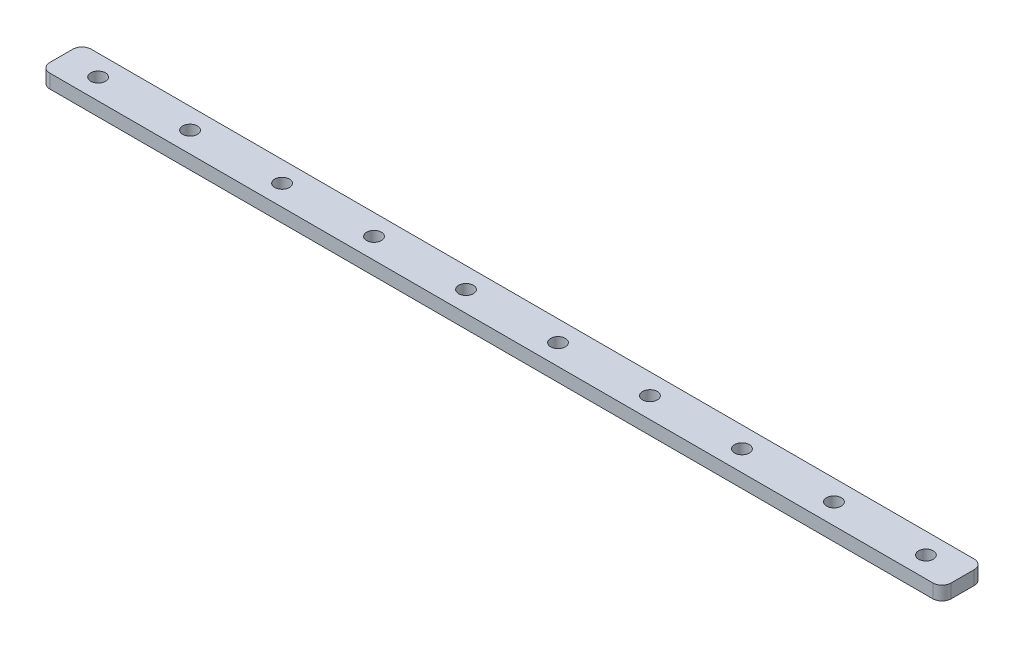
ISO-10303-21;
HEADER;
FILE_DESCRIPTION(('STEP AP214'),'2;1');
FILE_NAME('part.step','',(''),(''),'','','');
FILE_SCHEMA(('AUTOMOTIVE_DESIGN { 1 0 10303 214 1 1 1 1 }'));
ENDSEC;
DATA;
#1=APPLICATION_CONTEXT('core data for automotive mechanical design processes');
#2=APPLICATION_PROTOCOL_DEFINITION('international standard','automotive_design',2000,#1);
#3=PRODUCT_CONTEXT('',#1,'mechanical');
#4=PRODUCT('Part','Part','',(#3));
#5=PRODUCT_RELATED_PRODUCT_CATEGORY('part','',(#4));
#6=PRODUCT_DEFINITION_FORMATION('','',#4);
#7=PRODUCT_DEFINITION_CONTEXT('part definition',#1,'design');
#8=PRODUCT_DEFINITION('design','',#6,#7);
#9=PRODUCT_DEFINITION_SHAPE('','',#8);
#10=(LENGTH_UNIT() NAMED_UNIT(*) SI_UNIT(.MILLI.,.METRE.));
#11=(NAMED_UNIT(*) PLANE_ANGLE_UNIT() SI_UNIT($,.RADIAN.));
#12=(NAMED_UNIT(*) SI_UNIT($,.STERADIAN.) SOLID_ANGLE_UNIT());
#13=UNCERTAINTY_MEASURE_WITH_UNIT(LENGTH_MEASURE(1.E-05),#10,'distance_accuracy_value','');
#14=(GEOMETRIC_REPRESENTATION_CONTEXT(3) GLOBAL_UNCERTAINTY_ASSIGNED_CONTEXT((#13)) GLOBAL_UNIT_ASSIGNED_CONTEXT((#10,
#11,#12)) REPRESENTATION_CONTEXT('',''));
#15=CARTESIAN_POINT('',(0.,0.,0.));
#16=DIRECTION('',(0.,0.,1.));
#17=DIRECTION('',(1.,0.,0.));
#18=AXIS2_PLACEMENT_3D('',#15,#16,#17);
#19=CARTESIAN_POINT('',(0.,3.,0.));
#20=DIRECTION('',(0.,-1.,0.));
#21=DIRECTION('',(0.,0.,-1.));
#22=AXIS2_PLACEMENT_3D('',#19,#20,#21);
#23=PLANE('',#22);
#24=DIRECTION('',(-1.,0.,0.));
#25=VECTOR('',#24,1.);
#26=CARTESIAN_POINT('',(0.,3.,-9.));
#27=LINE('',#26,#25);
#28=CARTESIAN_POINT('',(194.,3.,-9.));
#29=VERTEX_POINT('',#28);
#30=CARTESIAN_POINT('',(2.,3.,-9.));
#31=VERTEX_POINT('',#30);
#32=EDGE_CURVE('E136',#29,#31,#27,.T.);
#33=ORIENTED_EDGE('',*,*,#32,.T.);
#34=CARTESIAN_POINT('',(2.,3.,-7.));
#35=DIRECTION('',(0.,-1.,0.));
#36=DIRECTION('',(0.,0.,-1.));
#37=AXIS2_PLACEMENT_3D('',#34,#35,#36);
#38=CIRCLE('',#37,2.);
#39=CARTESIAN_POINT('',(0.,3.,-7.));
#40=VERTEX_POINT('',#39);
#41=EDGE_CURVE('E155',#31,#40,#38,.F.);
#42=ORIENTED_EDGE('',*,*,#41,.T.);
#43=DIRECTION('',(0.,0.,1.));
#44=VECTOR('',#43,1.);
#45=CARTESIAN_POINT('',(0.,3.,0.));
#46=LINE('',#45,#44);
#47=CARTESIAN_POINT('',(0.,3.,-2.));
#48=VERTEX_POINT('',#47);
#49=EDGE_CURVE('E119',#40,#48,#46,.T.);
#50=ORIENTED_EDGE('',*,*,#49,.T.);
#51=CARTESIAN_POINT('',(2.,3.,-2.));
#52=DIRECTION('',(0.,-1.,0.));
#53=DIRECTION('',(0.,0.,-1.));
#54=AXIS2_PLACEMENT_3D('',#51,#52,#53);
#55=CIRCLE('',#54,2.);
#56=CARTESIAN_POINT('',(2.,3.,0.));
#57=VERTEX_POINT('',#56);
#58=EDGE_CURVE('E153',#48,#57,#55,.F.);
#59=ORIENTED_EDGE('',*,*,#58,.T.);
#60=DIRECTION('',(1.,0.,0.));
#61=VECTOR('',#60,1.);
#62=CARTESIAN_POINT('',(0.,3.,0.));
#63=LINE('',#62,#61);
#64=CARTESIAN_POINT('',(194.,3.,0.));
#65=VERTEX_POINT('',#64);
#66=EDGE_CURVE('E175',#57,#65,#63,.T.);
#67=ORIENTED_EDGE('',*,*,#66,.T.);
#68=CARTESIAN_POINT('',(194.,3.,-2.));
#69=DIRECTION('',(0.,-1.,0.));
#70=DIRECTION('',(0.,0.,-1.));
#71=AXIS2_PLACEMENT_3D('',#68,#69,#70);
#72=CIRCLE('',#71,2.);
#73=CARTESIAN_POINT('',(196.,3.,-1.99999999999999));
#74=VERTEX_POINT('',#73);
#75=EDGE_CURVE('E54',#65,#74,#72,.F.);
#76=ORIENTED_EDGE('',*,*,#75,.T.);
#77=DIRECTION('',(0.,0.,-1.));
#78=VECTOR('',#77,1.);
#79=CARTESIAN_POINT('',(196.,3.,0.));
#80=LINE('',#79,#78);
#81=CARTESIAN_POINT('',(196.,3.,-6.99999999999999));
#82=VERTEX_POINT('',#81);
#83=EDGE_CURVE('E165',#74,#82,#80,.T.);
#84=ORIENTED_EDGE('',*,*,#83,.T.);
#85=CARTESIAN_POINT('',(194.,3.,-7.));
#86=DIRECTION('',(0.,-1.,0.));
#87=DIRECTION('',(0.,0.,-1.));
#88=AXIS2_PLACEMENT_3D('',#85,#86,#87);
#89=CIRCLE('',#88,2.);
#90=EDGE_CURVE('E151',#82,#29,#89,.F.);
#91=ORIENTED_EDGE('',*,*,#90,.T.);
#92=EDGE_LOOP('',(#33,#42,#50,#59,#67,#76,#84,#91));
#93=FACE_BOUND('',#92,.T.);
#94=CARTESIAN_POINT('',(8.,3.,-4.5));
#95=DIRECTION('',(0.,1.,0.));
#96=DIRECTION('',(0.,0.,1.));
#97=AXIS2_PLACEMENT_3D('',#94,#95,#96);
#98=CIRCLE('',#97,1.6);
#99=CARTESIAN_POINT('',(8.,3.,-2.9));
#100=VERTEX_POINT('',#99);
#101=EDGE_CURVE('E127',#100,#100,#98,.T.);
#102=ORIENTED_EDGE('',*,*,#101,.F.);
#103=EDGE_LOOP('',(#102));
#104=FACE_BOUND('',#103,.T.);
#105=CARTESIAN_POINT('',(28.,3.,-4.5));
#106=DIRECTION('',(0.,1.,0.));
#107=DIRECTION('',(0.,0.,1.));
#108=AXIS2_PLACEMENT_3D('',#105,#106,#107);
#109=CIRCLE('',#108,1.60000000000001);
#110=CARTESIAN_POINT('',(28.,3.,-2.89999999999999));
#111=VERTEX_POINT('',#110);
#112=EDGE_CURVE('E180',#111,#111,#109,.T.);
#113=ORIENTED_EDGE('',*,*,#112,.F.);
#114=EDGE_LOOP('',(#113));
#115=FACE_BOUND('',#114,.T.);
#116=CARTESIAN_POINT('',(48.,3.,-4.5));
#117=DIRECTION('',(0.,1.,0.));
#118=DIRECTION('',(0.,0.,1.));
#119=AXIS2_PLACEMENT_3D('',#116,#117,#118);
#120=CIRCLE('',#119,1.6);
#121=CARTESIAN_POINT('',(48.,3.,-2.9));
#122=VERTEX_POINT('',#121);
#123=EDGE_CURVE('E185',#122,#122,#120,.T.);
#124=ORIENTED_EDGE('',*,*,#123,.F.);
#125=EDGE_LOOP('',(#124));
#126=FACE_BOUND('',#125,.T.);
#127=CARTESIAN_POINT('',(68.,3.,-4.5));
#128=DIRECTION('',(0.,1.,0.));
#129=DIRECTION('',(0.,0.,1.));
#130=AXIS2_PLACEMENT_3D('',#127,#128,#129);
#131=CIRCLE('',#130,1.60000000000001);
#132=CARTESIAN_POINT('',(68.,3.,-2.89999999999999));
#133=VERTEX_POINT('',#132);
#134=EDGE_CURVE('E191',#133,#133,#131,.T.);
#135=ORIENTED_EDGE('',*,*,#134,.F.);
#136=EDGE_LOOP('',(#135));
#137=FACE_BOUND('',#136,.T.);
#138=CARTESIAN_POINT('',(88.,3.,-4.5));
#139=DIRECTION('',(0.,1.,0.));
#140=DIRECTION('',(0.,0.,1.));
#141=AXIS2_PLACEMENT_3D('',#138,#139,#140);
#142=CIRCLE('',#141,1.60000000000001);
#143=CARTESIAN_POINT('',(88.,3.,-2.89999999999999));
#144=VERTEX_POINT('',#143);
#145=EDGE_CURVE('E197',#144,#144,#142,.T.);
#146=ORIENTED_EDGE('',*,*,#145,.F.);
#147=EDGE_LOOP('',(#146));
#148=FACE_BOUND('',#147,.T.);
#149=CARTESIAN_POINT('',(108.,3.,-4.5));
#150=DIRECTION('',(0.,1.,0.));
#151=DIRECTION('',(0.,0.,1.));
#152=AXIS2_PLACEMENT_3D('',#149,#150,#151);
#153=CIRCLE('',#152,1.60000000000001);
#154=CARTESIAN_POINT('',(108.,3.,-2.89999999999999));
#155=VERTEX_POINT('',#154);
#156=EDGE_CURVE('E203',#155,#155,#153,.T.);
#157=ORIENTED_EDGE('',*,*,#156,.F.);
#158=EDGE_LOOP('',(#157));
#159=FACE_BOUND('',#158,.T.);
#160=CARTESIAN_POINT('',(128.,3.,-4.5));
#161=DIRECTION('',(0.,1.,0.));
#162=DIRECTION('',(0.,0.,1.));
#163=AXIS2_PLACEMENT_3D('',#160,#161,#162);
#164=CIRCLE('',#163,1.59999999999999);
#165=CARTESIAN_POINT('',(128.,3.,-2.90000000000001));
#166=VERTEX_POINT('',#165);
#167=EDGE_CURVE('E209',#166,#166,#164,.T.);
#168=ORIENTED_EDGE('',*,*,#167,.F.);
#169=EDGE_LOOP('',(#168));
#170=FACE_BOUND('',#169,.T.);
#171=CARTESIAN_POINT('',(148.,3.,-4.5));
#172=DIRECTION('',(0.,1.,0.));
#173=DIRECTION('',(0.,0.,1.));
#174=AXIS2_PLACEMENT_3D('',#171,#172,#173);
#175=CIRCLE('',#174,1.59999999999999);
#176=CARTESIAN_POINT('',(148.,3.,-2.90000000000001));
#177=VERTEX_POINT('',#176);
#178=EDGE_CURVE('E215',#177,#177,#175,.T.);
#179=ORIENTED_EDGE('',*,*,#178,.F.);
#180=EDGE_LOOP('',(#179));
#181=FACE_BOUND('',#180,.T.);
#182=CARTESIAN_POINT('',(168.,3.,-4.5));
#183=DIRECTION('',(0.,1.,0.));
#184=DIRECTION('',(0.,0.,1.));
#185=AXIS2_PLACEMENT_3D('',#182,#183,#184);
#186=CIRCLE('',#185,1.59999999999999);
#187=CARTESIAN_POINT('',(168.,3.,-2.90000000000001));
#188=VERTEX_POINT('',#187);
#189=EDGE_CURVE('E221',#188,#188,#186,.T.);
#190=ORIENTED_EDGE('',*,*,#189,.F.);
#191=EDGE_LOOP('',(#190));
#192=FACE_BOUND('',#191,.T.);
#193=CARTESIAN_POINT('',(188.,3.,-4.5));
#194=DIRECTION('',(0.,1.,0.));
#195=DIRECTION('',(0.,0.,1.));
#196=AXIS2_PLACEMENT_3D('',#193,#194,#195);
#197=CIRCLE('',#196,1.59999999999999);
#198=CARTESIAN_POINT('',(188.,3.,-2.90000000000001));
#199=VERTEX_POINT('',#198);
#200=EDGE_CURVE('E227',#199,#199,#197,.T.);
#201=ORIENTED_EDGE('',*,*,#200,.F.);
#202=EDGE_LOOP('',(#201));
#203=FACE_BOUND('',#202,.T.);
#204=ADVANCED_FACE('F34',(#93,#104,#115,#126,#137,#148,#159,#170,#181,#192,#203),#23,.F.);
#205=CARTESIAN_POINT('',(0.,0.,0.));
#206=DIRECTION('',(0.,-1.,0.));
#207=DIRECTION('',(0.,0.,-1.));
#208=AXIS2_PLACEMENT_3D('',#205,#206,#207);
#209=PLANE('',#208);
#210=CARTESIAN_POINT('',(168.,0.,-4.5));
#211=DIRECTION('',(0.,1.,0.));
#212=DIRECTION('',(0.,0.,1.));
#213=AXIS2_PLACEMENT_3D('',#210,#211,#212);
#214=CIRCLE('',#213,1.59999999999999);
#215=CARTESIAN_POINT('',(168.,0.,-2.90000000000001));
#216=VERTEX_POINT('',#215);
#217=EDGE_CURVE('E224',#216,#216,#214,.T.);
#218=ORIENTED_EDGE('',*,*,#217,.T.);
#219=EDGE_LOOP('',(#218));
#220=FACE_BOUND('',#219,.T.);
#221=CARTESIAN_POINT('',(128.,0.,-4.5));
#222=DIRECTION('',(0.,1.,0.));
#223=DIRECTION('',(0.,0.,1.));
#224=AXIS2_PLACEMENT_3D('',#221,#222,#223);
#225=CIRCLE('',#224,1.59999999999999);
#226=CARTESIAN_POINT('',(128.,0.,-2.90000000000001));
#227=VERTEX_POINT('',#226);
#228=EDGE_CURVE('E212',#227,#227,#225,.T.);
#229=ORIENTED_EDGE('',*,*,#228,.T.);
#230=EDGE_LOOP('',(#229));
#231=FACE_BOUND('',#230,.T.);
#232=CARTESIAN_POINT('',(88.,0.,-4.5));
#233=DIRECTION('',(0.,1.,0.));
#234=DIRECTION('',(0.,0.,1.));
#235=AXIS2_PLACEMENT_3D('',#232,#233,#234);
#236=CIRCLE('',#235,1.60000000000001);
#237=CARTESIAN_POINT('',(88.,0.,-2.89999999999999));
#238=VERTEX_POINT('',#237);
#239=EDGE_CURVE('E200',#238,#238,#236,.T.);
#240=ORIENTED_EDGE('',*,*,#239,.T.);
#241=EDGE_LOOP('',(#240));
#242=FACE_BOUND('',#241,.T.);
#243=CARTESIAN_POINT('',(48.,0.,-4.5));
#244=DIRECTION('',(0.,1.,0.));
#245=DIRECTION('',(0.,0.,1.));
#246=AXIS2_PLACEMENT_3D('',#243,#244,#245);
#247=CIRCLE('',#246,1.6);
#248=CARTESIAN_POINT('',(48.,0.,-2.9));
#249=VERTEX_POINT('',#248);
#250=EDGE_CURVE('E188',#249,#249,#247,.T.);
#251=ORIENTED_EDGE('',*,*,#250,.T.);
#252=EDGE_LOOP('',(#251));
#253=FACE_BOUND('',#252,.T.);
#254=CARTESIAN_POINT('',(8.,0.,-4.5));
#255=DIRECTION('',(0.,1.,0.));
#256=DIRECTION('',(0.,0.,1.));
#257=AXIS2_PLACEMENT_3D('',#254,#255,#256);
#258=CIRCLE('',#257,1.6);
#259=CARTESIAN_POINT('',(8.,0.,-2.9));
#260=VERTEX_POINT('',#259);
#261=EDGE_CURVE('E133',#260,#260,#258,.T.);
#262=ORIENTED_EDGE('',*,*,#261,.T.);
#263=EDGE_LOOP('',(#262));
#264=FACE_BOUND('',#263,.T.);
#265=DIRECTION('',(0.,0.,1.));
#266=VECTOR('',#265,1.);
#267=CARTESIAN_POINT('',(0.,0.,0.));
#268=LINE('',#267,#266);
#269=CARTESIAN_POINT('',(0.,0.,-7.));
#270=VERTEX_POINT('',#269);
#271=CARTESIAN_POINT('',(0.,0.,-2.));
#272=VERTEX_POINT('',#271);
#273=EDGE_CURVE('E116',#270,#272,#268,.T.);
#274=ORIENTED_EDGE('',*,*,#273,.F.);
#275=CARTESIAN_POINT('',(2.,0.,-7.));
#276=DIRECTION('',(0.,-1.,0.));
#277=DIRECTION('',(0.,0.,-1.));
#278=AXIS2_PLACEMENT_3D('',#275,#276,#277);
#279=CIRCLE('',#278,2.);
#280=CARTESIAN_POINT('',(2.,0.,-9.));
#281=VERTEX_POINT('',#280);
#282=EDGE_CURVE('E99',#270,#281,#279,.T.);
#283=ORIENTED_EDGE('',*,*,#282,.T.);
#284=DIRECTION('',(-1.,0.,0.));
#285=VECTOR('',#284,1.);
#286=CARTESIAN_POINT('',(0.,0.,-9.));
#287=LINE('',#286,#285);
#288=CARTESIAN_POINT('',(194.,0.,-9.));
#289=VERTEX_POINT('',#288);
#290=EDGE_CURVE('E140',#289,#281,#287,.T.);
#291=ORIENTED_EDGE('',*,*,#290,.F.);
#292=CARTESIAN_POINT('',(194.,0.,-7.));
#293=DIRECTION('',(0.,-1.,0.));
#294=DIRECTION('',(0.,0.,-1.));
#295=AXIS2_PLACEMENT_3D('',#292,#293,#294);
#296=CIRCLE('',#295,2.);
#297=CARTESIAN_POINT('',(196.,0.,-6.99999999999999));
#298=VERTEX_POINT('',#297);
#299=EDGE_CURVE('E144',#289,#298,#296,.T.);
#300=ORIENTED_EDGE('',*,*,#299,.T.);
#301=DIRECTION('',(0.,0.,-1.));
#302=VECTOR('',#301,1.);
#303=CARTESIAN_POINT('',(196.,0.,0.));
#304=LINE('',#303,#302);
#305=CARTESIAN_POINT('',(196.,0.,-1.99999999999999));
#306=VERTEX_POINT('',#305);
#307=EDGE_CURVE('E130',#306,#298,#304,.T.);
#308=ORIENTED_EDGE('',*,*,#307,.F.);
#309=CARTESIAN_POINT('',(194.,0.,-2.));
#310=DIRECTION('',(0.,-1.,0.));
#311=DIRECTION('',(0.,0.,-1.));
#312=AXIS2_PLACEMENT_3D('',#309,#310,#311);
#313=CIRCLE('',#312,2.);
#314=CARTESIAN_POINT('',(194.,0.,0.));
#315=VERTEX_POINT('',#314);
#316=EDGE_CURVE('E120',#306,#315,#313,.T.);
#317=ORIENTED_EDGE('',*,*,#316,.T.);
#318=DIRECTION('',(1.,0.,0.));
#319=VECTOR('',#318,1.);
#320=CARTESIAN_POINT('',(0.,0.,0.));
#321=LINE('',#320,#319);
#322=CARTESIAN_POINT('',(2.,0.,0.));
#323=VERTEX_POINT('',#322);
#324=EDGE_CURVE('E126',#323,#315,#321,.T.);
#325=ORIENTED_EDGE('',*,*,#324,.F.);
#326=CARTESIAN_POINT('',(2.,0.,-2.));
#327=DIRECTION('',(0.,-1.,0.));
#328=DIRECTION('',(0.,0.,-1.));
#329=AXIS2_PLACEMENT_3D('',#326,#327,#328);
#330=CIRCLE('',#329,2.);
#331=EDGE_CURVE('E110',#323,#272,#330,.T.);
#332=ORIENTED_EDGE('',*,*,#331,.T.);
#333=EDGE_LOOP('',(#274,#283,#291,#300,#308,#317,#325,#332));
#334=FACE_BOUND('',#333,.T.);
#335=CARTESIAN_POINT('',(28.,0.,-4.5));
#336=DIRECTION('',(0.,1.,0.));
#337=DIRECTION('',(0.,0.,1.));
#338=AXIS2_PLACEMENT_3D('',#335,#336,#337);
#339=CIRCLE('',#338,1.60000000000001);
#340=CARTESIAN_POINT('',(28.,0.,-2.89999999999999));
#341=VERTEX_POINT('',#340);
#342=EDGE_CURVE('E182',#341,#341,#339,.T.);
#343=ORIENTED_EDGE('',*,*,#342,.T.);
#344=EDGE_LOOP('',(#343));
#345=FACE_BOUND('',#344,.T.);
#346=CARTESIAN_POINT('',(68.,0.,-4.5));
#347=DIRECTION('',(0.,1.,0.));
#348=DIRECTION('',(0.,0.,1.));
#349=AXIS2_PLACEMENT_3D('',#346,#347,#348);
#350=CIRCLE('',#349,1.60000000000001);
#351=CARTESIAN_POINT('',(68.,0.,-2.89999999999999));
#352=VERTEX_POINT('',#351);
#353=EDGE_CURVE('E194',#352,#352,#350,.T.);
#354=ORIENTED_EDGE('',*,*,#353,.T.);
#355=EDGE_LOOP('',(#354));
#356=FACE_BOUND('',#355,.T.);
#357=CARTESIAN_POINT('',(108.,0.,-4.5));
#358=DIRECTION('',(0.,1.,0.));
#359=DIRECTION('',(0.,0.,1.));
#360=AXIS2_PLACEMENT_3D('',#357,#358,#359);
#361=CIRCLE('',#360,1.60000000000001);
#362=CARTESIAN_POINT('',(108.,0.,-2.89999999999999));
#363=VERTEX_POINT('',#362);
#364=EDGE_CURVE('E206',#363,#363,#361,.T.);
#365=ORIENTED_EDGE('',*,*,#364,.T.);
#366=EDGE_LOOP('',(#365));
#367=FACE_BOUND('',#366,.T.);
#368=CARTESIAN_POINT('',(148.,0.,-4.5));
#369=DIRECTION('',(0.,1.,0.));
#370=DIRECTION('',(0.,0.,1.));
#371=AXIS2_PLACEMENT_3D('',#368,#369,#370);
#372=CIRCLE('',#371,1.59999999999999);
#373=CARTESIAN_POINT('',(148.,0.,-2.90000000000001));
#374=VERTEX_POINT('',#373);
#375=EDGE_CURVE('E218',#374,#374,#372,.T.);
#376=ORIENTED_EDGE('',*,*,#375,.T.);
#377=EDGE_LOOP('',(#376));
#378=FACE_BOUND('',#377,.T.);
#379=CARTESIAN_POINT('',(188.,0.,-4.5));
#380=DIRECTION('',(0.,1.,0.));
#381=DIRECTION('',(0.,0.,1.));
#382=AXIS2_PLACEMENT_3D('',#379,#380,#381);
#383=CIRCLE('',#382,1.59999999999999);
#384=CARTESIAN_POINT('',(188.,0.,-2.90000000000001));
#385=VERTEX_POINT('',#384);
#386=EDGE_CURVE('E230',#385,#385,#383,.T.);
#387=ORIENTED_EDGE('',*,*,#386,.T.);
#388=EDGE_LOOP('',(#387));
#389=FACE_BOUND('',#388,.T.);
#390=ADVANCED_FACE('F123',(#220,#231,#242,#253,#264,#334,#345,#356,#367,#378,#389),#209,.T.);
#391=CARTESIAN_POINT('',(0.,3.,0.));
#392=DIRECTION('',(1.,0.,0.));
#393=DIRECTION('',(0.,0.,-1.));
#394=AXIS2_PLACEMENT_3D('',#391,#392,#393);
#395=PLANE('',#394);
#396=ORIENTED_EDGE('',*,*,#49,.F.);
#397=DIRECTION('',(0.,-1.,0.));
#398=VECTOR('',#397,1.);
#399=CARTESIAN_POINT('',(0.,3.,-7.));
#400=LINE('',#399,#398);
#401=EDGE_CURVE('E103',#40,#270,#400,.T.);
#402=ORIENTED_EDGE('',*,*,#401,.T.);
#403=ORIENTED_EDGE('',*,*,#273,.T.);
#404=DIRECTION('',(0.,-1.,0.));
#405=VECTOR('',#404,1.);
#406=CARTESIAN_POINT('',(0.,3.,-2.));
#407=LINE('',#406,#405);
#408=EDGE_CURVE('E121',#272,#48,#407,.F.);
#409=ORIENTED_EDGE('',*,*,#408,.T.);
#410=EDGE_LOOP('',(#396,#402,#403,#409));
#411=FACE_BOUND('',#410,.T.);
#412=ADVANCED_FACE('F115',(#411),#395,.F.);
#413=CARTESIAN_POINT('',(0.,3.,0.));
#414=DIRECTION('',(0.,0.,-1.));
#415=DIRECTION('',(-1.,0.,0.));
#416=AXIS2_PLACEMENT_3D('',#413,#414,#415);
#417=PLANE('',#416);
#418=ORIENTED_EDGE('',*,*,#66,.F.);
#419=DIRECTION('',(0.,-1.,0.));
#420=VECTOR('',#419,1.);
#421=CARTESIAN_POINT('',(2.,3.,0.));
#422=LINE('',#421,#420);
#423=EDGE_CURVE('E159',#57,#323,#422,.T.);
#424=ORIENTED_EDGE('',*,*,#423,.T.);
#425=ORIENTED_EDGE('',*,*,#324,.T.);
#426=DIRECTION('',(0.,-1.,0.));
#427=VECTOR('',#426,1.);
#428=CARTESIAN_POINT('',(194.,3.,0.));
#429=LINE('',#428,#427);
#430=EDGE_CURVE('E157',#315,#65,#429,.F.);
#431=ORIENTED_EDGE('',*,*,#430,.T.);
#432=EDGE_LOOP('',(#418,#424,#425,#431));
#433=FACE_BOUND('',#432,.T.);
#434=ADVANCED_FACE('F255',(#433),#417,.F.);
#435=CARTESIAN_POINT('',(196.,3.,0.));
#436=DIRECTION('',(-1.,0.,0.));
#437=DIRECTION('',(0.,0.,1.));
#438=AXIS2_PLACEMENT_3D('',#435,#436,#437);
#439=PLANE('',#438);
#440=ORIENTED_EDGE('',*,*,#307,.T.);
#441=DIRECTION('',(0.,-1.,0.));
#442=VECTOR('',#441,1.);
#443=CARTESIAN_POINT('',(196.,3.,-6.99999999999999));
#444=LINE('',#443,#442);
#445=EDGE_CURVE('E11',#298,#82,#444,.F.);
#446=ORIENTED_EDGE('',*,*,#445,.T.);
#447=ORIENTED_EDGE('',*,*,#83,.F.);
#448=DIRECTION('',(0.,-1.,0.));
#449=VECTOR('',#448,1.);
#450=CARTESIAN_POINT('',(196.,3.,-1.99999999999999));
#451=LINE('',#450,#449);
#452=EDGE_CURVE('E42',#74,#306,#451,.T.);
#453=ORIENTED_EDGE('',*,*,#452,.T.);
#454=EDGE_LOOP('',(#440,#446,#447,#453));
#455=FACE_BOUND('',#454,.T.);
#456=ADVANCED_FACE('F164',(#455),#439,.F.);
#457=CARTESIAN_POINT('',(0.,3.,-9.));
#458=DIRECTION('',(0.,0.,1.));
#459=DIRECTION('',(1.,0.,0.));
#460=AXIS2_PLACEMENT_3D('',#457,#458,#459);
#461=PLANE('',#460);
#462=ORIENTED_EDGE('',*,*,#290,.T.);
#463=DIRECTION('',(0.,-1.,0.));
#464=VECTOR('',#463,1.);
#465=CARTESIAN_POINT('',(2.,3.,-9.));
#466=LINE('',#465,#464);
#467=EDGE_CURVE('E104',#281,#31,#466,.F.);
#468=ORIENTED_EDGE('',*,*,#467,.T.);
#469=ORIENTED_EDGE('',*,*,#32,.F.);
#470=DIRECTION('',(0.,-1.,0.));
#471=VECTOR('',#470,1.);
#472=CARTESIAN_POINT('',(194.,3.,-9.));
#473=LINE('',#472,#471);
#474=EDGE_CURVE('E109',#29,#289,#473,.T.);
#475=ORIENTED_EDGE('',*,*,#474,.T.);
#476=EDGE_LOOP('',(#462,#468,#469,#475));
#477=FACE_BOUND('',#476,.T.);
#478=ADVANCED_FACE('F173',(#477),#461,.F.);
#479=CARTESIAN_POINT('',(8.,3.,-4.5));
#480=DIRECTION('',(0.,-1.,0.));
#481=DIRECTION('',(0.,0.,-1.));
#482=AXIS2_PLACEMENT_3D('',#479,#480,#481);
#483=CYLINDRICAL_SURFACE('',#482,1.6);
#484=ORIENTED_EDGE('',*,*,#101,.T.);
#485=EDGE_LOOP('',(#484));
#486=FACE_BOUND('',#485,.T.);
#487=ORIENTED_EDGE('',*,*,#261,.F.);
#488=EDGE_LOOP('',(#487));
#489=FACE_BOUND('',#488,.T.);
#490=ADVANCED_FACE('F248',(#486,#489),#483,.F.);
#491=CARTESIAN_POINT('',(28.,3.,-4.5));
#492=DIRECTION('',(0.,-1.,0.));
#493=DIRECTION('',(0.,0.,-1.));
#494=AXIS2_PLACEMENT_3D('',#491,#492,#493);
#495=CYLINDRICAL_SURFACE('',#494,1.60000000000001);
#496=ORIENTED_EDGE('',*,*,#112,.T.);
#497=EDGE_LOOP('',(#496));
#498=FACE_BOUND('',#497,.T.);
#499=ORIENTED_EDGE('',*,*,#342,.F.);
#500=EDGE_LOOP('',(#499));
#501=FACE_BOUND('',#500,.T.);
#502=ADVANCED_FACE('F406',(#498,#501),#495,.F.);
#503=CARTESIAN_POINT('',(48.,3.,-4.5));
#504=DIRECTION('',(0.,-1.,0.));
#505=DIRECTION('',(0.,0.,-1.));
#506=AXIS2_PLACEMENT_3D('',#503,#504,#505);
#507=CYLINDRICAL_SURFACE('',#506,1.6);
#508=ORIENTED_EDGE('',*,*,#123,.T.);
#509=EDGE_LOOP('',(#508));
#510=FACE_BOUND('',#509,.T.);
#511=ORIENTED_EDGE('',*,*,#250,.F.);
#512=EDGE_LOOP('',(#511));
#513=FACE_BOUND('',#512,.T.);
#514=ADVANCED_FACE('F396',(#510,#513),#507,.F.);
#515=CARTESIAN_POINT('',(68.,3.,-4.5));
#516=DIRECTION('',(0.,-1.,0.));
#517=DIRECTION('',(0.,0.,-1.));
#518=AXIS2_PLACEMENT_3D('',#515,#516,#517);
#519=CYLINDRICAL_SURFACE('',#518,1.60000000000001);
#520=ORIENTED_EDGE('',*,*,#134,.T.);
#521=EDGE_LOOP('',(#520));
#522=FACE_BOUND('',#521,.T.);
#523=ORIENTED_EDGE('',*,*,#353,.F.);
#524=EDGE_LOOP('',(#523));
#525=FACE_BOUND('',#524,.T.);
#526=ADVANCED_FACE('F386',(#522,#525),#519,.F.);
#527=CARTESIAN_POINT('',(88.,3.,-4.5));
#528=DIRECTION('',(0.,-1.,0.));
#529=DIRECTION('',(0.,0.,-1.));
#530=AXIS2_PLACEMENT_3D('',#527,#528,#529);
#531=CYLINDRICAL_SURFACE('',#530,1.60000000000001);
#532=ORIENTED_EDGE('',*,*,#145,.T.);
#533=EDGE_LOOP('',(#532));
#534=FACE_BOUND('',#533,.T.);
#535=ORIENTED_EDGE('',*,*,#239,.F.);
#536=EDGE_LOOP('',(#535));
#537=FACE_BOUND('',#536,.T.);
#538=ADVANCED_FACE('F376',(#534,#537),#531,.F.);
#539=CARTESIAN_POINT('',(108.,3.,-4.5));
#540=DIRECTION('',(0.,-1.,0.));
#541=DIRECTION('',(0.,0.,-1.));
#542=AXIS2_PLACEMENT_3D('',#539,#540,#541);
#543=CYLINDRICAL_SURFACE('',#542,1.60000000000001);
#544=ORIENTED_EDGE('',*,*,#156,.T.);
#545=EDGE_LOOP('',(#544));
#546=FACE_BOUND('',#545,.T.);
#547=ORIENTED_EDGE('',*,*,#364,.F.);
#548=EDGE_LOOP('',(#547));
#549=FACE_BOUND('',#548,.T.);
#550=ADVANCED_FACE('F366',(#546,#549),#543,.F.);
#551=CARTESIAN_POINT('',(128.,3.,-4.5));
#552=DIRECTION('',(0.,-1.,0.));
#553=DIRECTION('',(0.,0.,-1.));
#554=AXIS2_PLACEMENT_3D('',#551,#552,#553);
#555=CYLINDRICAL_SURFACE('',#554,1.59999999999999);
#556=ORIENTED_EDGE('',*,*,#167,.T.);
#557=EDGE_LOOP('',(#556));
#558=FACE_BOUND('',#557,.T.);
#559=ORIENTED_EDGE('',*,*,#228,.F.);
#560=EDGE_LOOP('',(#559));
#561=FACE_BOUND('',#560,.T.);
#562=ADVANCED_FACE('F356',(#558,#561),#555,.F.);
#563=CARTESIAN_POINT('',(148.,3.,-4.5));
#564=DIRECTION('',(0.,-1.,0.));
#565=DIRECTION('',(0.,0.,-1.));
#566=AXIS2_PLACEMENT_3D('',#563,#564,#565);
#567=CYLINDRICAL_SURFACE('',#566,1.59999999999999);
#568=ORIENTED_EDGE('',*,*,#178,.T.);
#569=EDGE_LOOP('',(#568));
#570=FACE_BOUND('',#569,.T.);
#571=ORIENTED_EDGE('',*,*,#375,.F.);
#572=EDGE_LOOP('',(#571));
#573=FACE_BOUND('',#572,.T.);
#574=ADVANCED_FACE('F346',(#570,#573),#567,.F.);
#575=CARTESIAN_POINT('',(168.,3.,-4.5));
#576=DIRECTION('',(0.,-1.,0.));
#577=DIRECTION('',(0.,0.,-1.));
#578=AXIS2_PLACEMENT_3D('',#575,#576,#577);
#579=CYLINDRICAL_SURFACE('',#578,1.59999999999999);
#580=ORIENTED_EDGE('',*,*,#189,.T.);
#581=EDGE_LOOP('',(#580));
#582=FACE_BOUND('',#581,.T.);
#583=ORIENTED_EDGE('',*,*,#217,.F.);
#584=EDGE_LOOP('',(#583));
#585=FACE_BOUND('',#584,.T.);
#586=ADVANCED_FACE('F337',(#582,#585),#579,.F.);
#587=CARTESIAN_POINT('',(188.,3.,-4.5));
#588=DIRECTION('',(0.,-1.,0.));
#589=DIRECTION('',(0.,0.,-1.));
#590=AXIS2_PLACEMENT_3D('',#587,#588,#589);
#591=CYLINDRICAL_SURFACE('',#590,1.59999999999999);
#592=ORIENTED_EDGE('',*,*,#200,.T.);
#593=EDGE_LOOP('',(#592));
#594=FACE_BOUND('',#593,.T.);
#595=ORIENTED_EDGE('',*,*,#386,.F.);
#596=EDGE_LOOP('',(#595));
#597=FACE_BOUND('',#596,.T.);
#598=ADVANCED_FACE('F236',(#594,#597),#591,.F.);
#599=CARTESIAN_POINT('',(2.,3.,-7.));
#600=DIRECTION('',(0.,-1.,0.));
#601=DIRECTION('',(0.,0.,-1.));
#602=AXIS2_PLACEMENT_3D('',#599,#600,#601);
#603=CYLINDRICAL_SURFACE('',#602,2.);
#604=ORIENTED_EDGE('',*,*,#41,.F.);
#605=ORIENTED_EDGE('',*,*,#467,.F.);
#606=ORIENTED_EDGE('',*,*,#282,.F.);
#607=ORIENTED_EDGE('',*,*,#401,.F.);
#608=EDGE_LOOP('',(#604,#605,#606,#607));
#609=FACE_BOUND('',#608,.T.);
#610=ADVANCED_FACE('F102',(#609),#603,.T.);
#611=CARTESIAN_POINT('',(2.,3.,-2.));
#612=DIRECTION('',(0.,-1.,0.));
#613=DIRECTION('',(0.,0.,-1.));
#614=AXIS2_PLACEMENT_3D('',#611,#612,#613);
#615=CYLINDRICAL_SURFACE('',#614,2.);
#616=ORIENTED_EDGE('',*,*,#58,.F.);
#617=ORIENTED_EDGE('',*,*,#408,.F.);
#618=ORIENTED_EDGE('',*,*,#331,.F.);
#619=ORIENTED_EDGE('',*,*,#423,.F.);
#620=EDGE_LOOP('',(#616,#617,#618,#619));
#621=FACE_BOUND('',#620,.T.);
#622=ADVANCED_FACE('F263',(#621),#615,.T.);
#623=CARTESIAN_POINT('',(194.,3.,-7.));
#624=DIRECTION('',(0.,-1.,0.));
#625=DIRECTION('',(0.,0.,-1.));
#626=AXIS2_PLACEMENT_3D('',#623,#624,#625);
#627=CYLINDRICAL_SURFACE('',#626,2.);
#628=ORIENTED_EDGE('',*,*,#90,.F.);
#629=ORIENTED_EDGE('',*,*,#445,.F.);
#630=ORIENTED_EDGE('',*,*,#299,.F.);
#631=ORIENTED_EDGE('',*,*,#474,.F.);
#632=EDGE_LOOP('',(#628,#629,#630,#631));
#633=FACE_BOUND('',#632,.T.);
#634=ADVANCED_FACE('F170',(#633),#627,.T.);
#635=CARTESIAN_POINT('',(194.,3.,-2.));
#636=DIRECTION('',(0.,-1.,0.));
#637=DIRECTION('',(0.,0.,-1.));
#638=AXIS2_PLACEMENT_3D('',#635,#636,#637);
#639=CYLINDRICAL_SURFACE('',#638,2.);
#640=ORIENTED_EDGE('',*,*,#75,.F.);
#641=ORIENTED_EDGE('',*,*,#430,.F.);
#642=ORIENTED_EDGE('',*,*,#316,.F.);
#643=ORIENTED_EDGE('',*,*,#452,.F.);
#644=EDGE_LOOP('',(#640,#641,#642,#643));
#645=FACE_BOUND('',#644,.T.);
#646=ADVANCED_FACE('F36',(#645),#639,.T.);
#647=CLOSED_SHELL('',(#204,#390,#412,#434,#456,#478,#490,#502,#514,#526,#538,#550,#562,#574,
#586,#598,#610,#622,#634,#646));
#648=MANIFOLD_SOLID_BREP('B2',#647);
#649=ADVANCED_BREP_SHAPE_REPRESENTATION('',(#18,#648),#14);
#650=SHAPE_DEFINITION_REPRESENTATION(#9,#649);
ENDSEC;
END-ISO-10303-21;
